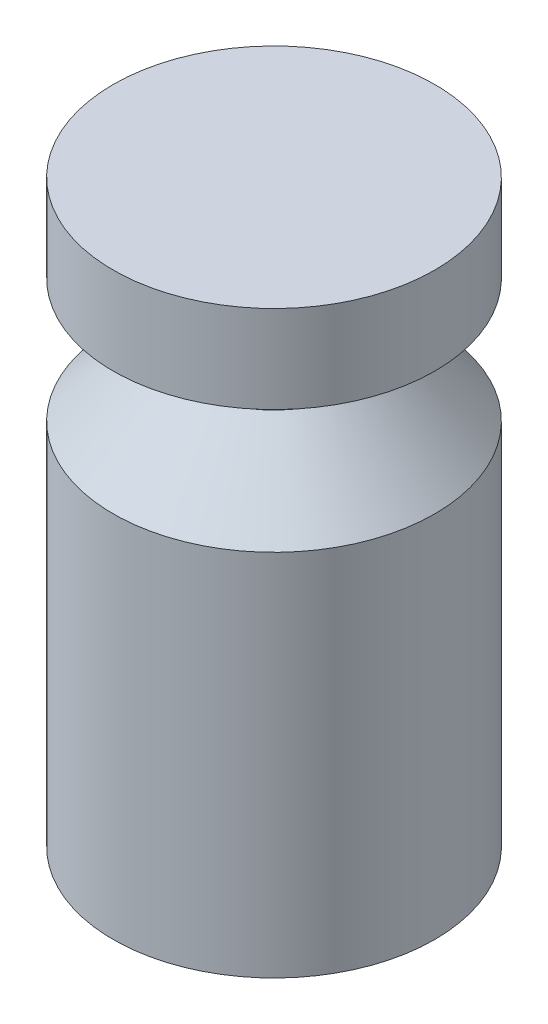
ISO-10303-21;
HEADER;
FILE_DESCRIPTION(('STEP AP214'),'2;1');
FILE_NAME('part.step','',(''),(''),'','','');
FILE_SCHEMA(('AUTOMOTIVE_DESIGN { 1 0 10303 214 1 1 1 1 }'));
ENDSEC;
DATA;
#1=APPLICATION_CONTEXT('core data for automotive mechanical design processes');
#2=APPLICATION_PROTOCOL_DEFINITION('international standard','automotive_design',2000,#1);
#3=PRODUCT_CONTEXT('',#1,'mechanical');
#4=PRODUCT('Part','Part','',(#3));
#5=PRODUCT_RELATED_PRODUCT_CATEGORY('part','',(#4));
#6=PRODUCT_DEFINITION_FORMATION('','',#4);
#7=PRODUCT_DEFINITION_CONTEXT('part definition',#1,'design');
#8=PRODUCT_DEFINITION('design','',#6,#7);
#9=PRODUCT_DEFINITION_SHAPE('','',#8);
#10=(LENGTH_UNIT() NAMED_UNIT(*) SI_UNIT(.MILLI.,.METRE.));
#11=(NAMED_UNIT(*) PLANE_ANGLE_UNIT() SI_UNIT($,.RADIAN.));
#12=(NAMED_UNIT(*) SI_UNIT($,.STERADIAN.) SOLID_ANGLE_UNIT());
#13=UNCERTAINTY_MEASURE_WITH_UNIT(LENGTH_MEASURE(1.E-05),#10,'distance_accuracy_value','');
#14=(GEOMETRIC_REPRESENTATION_CONTEXT(3) GLOBAL_UNCERTAINTY_ASSIGNED_CONTEXT((#13)) GLOBAL_UNIT_ASSIGNED_CONTEXT((#10,
#11,#12)) REPRESENTATION_CONTEXT('',''));
#15=CARTESIAN_POINT('',(0.,0.,0.));
#16=DIRECTION('',(0.,0.,1.));
#17=DIRECTION('',(1.,0.,0.));
#18=AXIS2_PLACEMENT_3D('',#15,#16,#17);
#19=CARTESIAN_POINT('',(0.,0.,0.));
#20=DIRECTION('',(0.,1.,0.));
#21=DIRECTION('',(-1.,0.,0.));
#22=AXIS2_PLACEMENT_3D('',#19,#20,#21);
#23=PLANE('',#22);
#24=CARTESIAN_POINT('',(0.,0.,0.));
#25=DIRECTION('',(0.,1.,0.));
#26=DIRECTION('',(-1.,0.,0.));
#27=AXIS2_PLACEMENT_3D('',#24,#25,#26);
#28=CIRCLE('',#27,14.6978282627078);
#29=CARTESIAN_POINT('',(-14.6978282627078,0.,0.));
#30=VERTEX_POINT('',#29);
#31=EDGE_CURVE('E10',#30,#30,#28,.T.);
#32=ORIENTED_EDGE('',*,*,#31,.F.);
#33=EDGE_LOOP('',(#32));
#34=FACE_BOUND('',#33,.T.);
#35=ADVANCED_FACE('F31',(#34),#23,.F.);
#36=CARTESIAN_POINT('',(0.,53.,0.));
#37=DIRECTION('',(0.,1.,0.));
#38=DIRECTION('',(-1.,0.,0.));
#39=AXIS2_PLACEMENT_3D('',#36,#37,#38);
#40=CYLINDRICAL_SURFACE('',#39,14.6978282627079);
#41=CARTESIAN_POINT('',(0.,33.7,0.));
#42=DIRECTION('',(0.,1.,0.));
#43=DIRECTION('',(-1.,0.,0.));
#44=AXIS2_PLACEMENT_3D('',#41,#42,#43);
#45=CIRCLE('',#44,14.6978282627079);
#46=CARTESIAN_POINT('',(-14.6978282627079,33.7,0.));
#47=VERTEX_POINT('',#46);
#48=EDGE_CURVE('E37',#47,#47,#45,.T.);
#49=ORIENTED_EDGE('',*,*,#48,.F.);
#50=EDGE_LOOP('',(#49));
#51=FACE_BOUND('',#50,.T.);
#52=ORIENTED_EDGE('',*,*,#31,.T.);
#53=EDGE_LOOP('',(#52));
#54=FACE_BOUND('',#53,.T.);
#55=ADVANCED_FACE('F79',(#51,#54),#40,.T.);
#56=CARTESIAN_POINT('',(0.,33.7,0.));
#57=DIRECTION('',(0.,-1.,0.));
#58=DIRECTION('',(1.,0.,0.));
#59=AXIS2_PLACEMENT_3D('',#56,#57,#58);
#60=CONICAL_SURFACE('',#59,14.6978282627079,0.766220789186172);
#61=CARTESIAN_POINT('',(0.,40.4,0.));
#62=DIRECTION('',(0.,1.,0.));
#63=DIRECTION('',(-1.,0.,0.));
#64=AXIS2_PLACEMENT_3D('',#61,#62,#63);
#65=CIRCLE('',#64,8.25);
#66=CARTESIAN_POINT('',(-8.25,40.4,0.));
#67=VERTEX_POINT('',#66);
#68=EDGE_CURVE('E41',#67,#67,#65,.T.);
#69=ORIENTED_EDGE('',*,*,#68,.F.);
#70=EDGE_LOOP('',(#69));
#71=FACE_BOUND('',#70,.T.);
#72=ORIENTED_EDGE('',*,*,#48,.T.);
#73=EDGE_LOOP('',(#72));
#74=FACE_BOUND('',#73,.T.);
#75=ADVANCED_FACE('F74',(#71,#74),#60,.T.);
#76=CARTESIAN_POINT('',(0.,53.,0.));
#77=DIRECTION('',(0.,1.,0.));
#78=DIRECTION('',(-1.,0.,0.));
#79=AXIS2_PLACEMENT_3D('',#76,#77,#78);
#80=CYLINDRICAL_SURFACE('',#79,8.25);
#81=CARTESIAN_POINT('',(0.,45.,0.));
#82=DIRECTION('',(0.,1.,0.));
#83=DIRECTION('',(-1.,0.,0.));
#84=AXIS2_PLACEMENT_3D('',#81,#82,#83);
#85=CIRCLE('',#84,8.25);
#86=CARTESIAN_POINT('',(-8.25,45.,0.));
#87=VERTEX_POINT('',#86);
#88=EDGE_CURVE('E45',#87,#87,#85,.T.);
#89=ORIENTED_EDGE('',*,*,#88,.F.);
#90=EDGE_LOOP('',(#89));
#91=FACE_BOUND('',#90,.T.);
#92=ORIENTED_EDGE('',*,*,#68,.T.);
#93=EDGE_LOOP('',(#92));
#94=FACE_BOUND('',#93,.T.);
#95=ADVANCED_FACE('F68',(#91,#94),#80,.T.);
#96=CARTESIAN_POINT('',(8.25,45.,0.));
#97=DIRECTION('',(0.,1.,0.));
#98=DIRECTION('',(-1.,0.,0.));
#99=AXIS2_PLACEMENT_3D('',#96,#97,#98);
#100=PLANE('',#99);
#101=CARTESIAN_POINT('',(0.,45.,0.));
#102=DIRECTION('',(0.,1.,0.));
#103=DIRECTION('',(-1.,0.,0.));
#104=AXIS2_PLACEMENT_3D('',#101,#102,#103);
#105=CIRCLE('',#104,14.6978282627079);
#106=CARTESIAN_POINT('',(-14.6978282627079,45.,0.));
#107=VERTEX_POINT('',#106);
#108=EDGE_CURVE('E50',#107,#107,#105,.T.);
#109=ORIENTED_EDGE('',*,*,#108,.F.);
#110=EDGE_LOOP('',(#109));
#111=FACE_BOUND('',#110,.T.);
#112=ORIENTED_EDGE('',*,*,#88,.T.);
#113=EDGE_LOOP('',(#112));
#114=FACE_BOUND('',#113,.T.);
#115=ADVANCED_FACE('F62',(#111,#114),#100,.F.);
#116=CARTESIAN_POINT('',(0.,53.,0.));
#117=DIRECTION('',(0.,1.,0.));
#118=DIRECTION('',(-1.,0.,0.));
#119=AXIS2_PLACEMENT_3D('',#116,#117,#118);
#120=CYLINDRICAL_SURFACE('',#119,14.6978282627079);
#121=CARTESIAN_POINT('',(0.,53.,0.));
#122=DIRECTION('',(0.,1.,0.));
#123=DIRECTION('',(-1.,0.,0.));
#124=AXIS2_PLACEMENT_3D('',#121,#122,#123);
#125=CIRCLE('',#124,14.6978282627079);
#126=CARTESIAN_POINT('',(-14.6978282627079,53.,0.));
#127=VERTEX_POINT('',#126);
#128=EDGE_CURVE('E53',#127,#127,#125,.T.);
#129=ORIENTED_EDGE('',*,*,#128,.F.);
#130=EDGE_LOOP('',(#129));
#131=FACE_BOUND('',#130,.T.);
#132=ORIENTED_EDGE('',*,*,#108,.T.);
#133=EDGE_LOOP('',(#132));
#134=FACE_BOUND('',#133,.T.);
#135=ADVANCED_FACE('F59',(#131,#134),#120,.T.);
#136=CARTESIAN_POINT('',(14.6978282627079,53.,0.));
#137=DIRECTION('',(0.,-1.,0.));
#138=DIRECTION('',(1.,0.,0.));
#139=AXIS2_PLACEMENT_3D('',#136,#137,#138);
#140=PLANE('',#139);
#141=ORIENTED_EDGE('',*,*,#128,.T.);
#142=EDGE_LOOP('',(#141));
#143=FACE_BOUND('',#142,.T.);
#144=ADVANCED_FACE('F57',(#143),#140,.F.);
#145=CLOSED_SHELL('',(#35,#55,#75,#95,#115,#135,#144));
#146=MANIFOLD_SOLID_BREP('B2',#145);
#147=ADVANCED_BREP_SHAPE_REPRESENTATION('',(#18,#146),#14);
#148=SHAPE_DEFINITION_REPRESENTATION(#9,#147);
ENDSEC;
END-ISO-10303-21;
